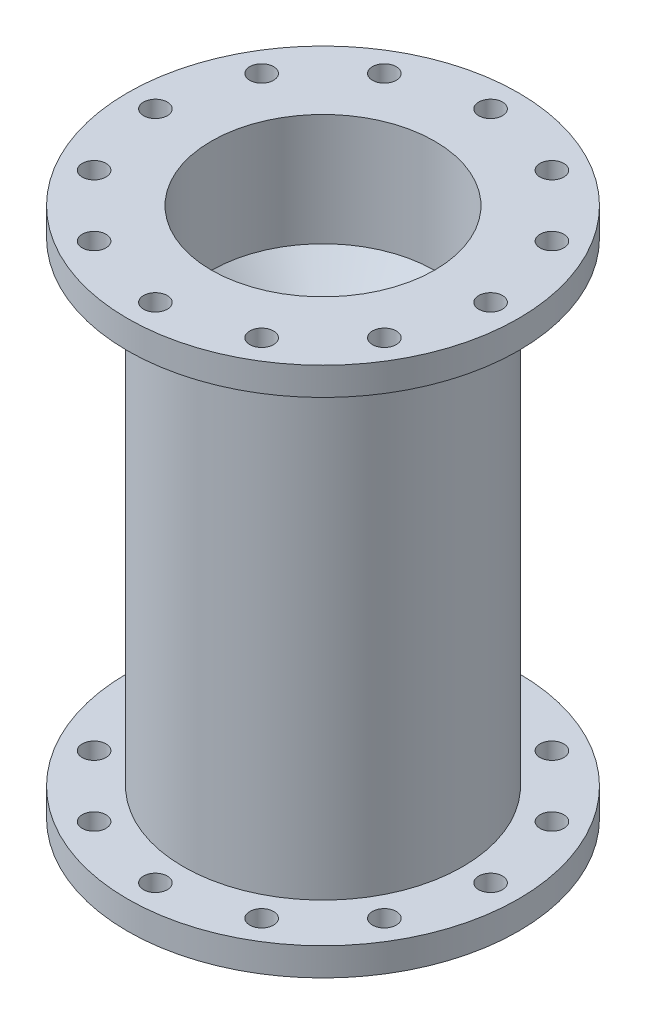
ISO-10303-21;
HEADER;
FILE_DESCRIPTION(('STEP AP214'),'2;1');
FILE_NAME('part.step','',(''),(''),'','','');
FILE_SCHEMA(('AUTOMOTIVE_DESIGN { 1 0 10303 214 1 1 1 1 }'));
ENDSEC;
DATA;
#1=APPLICATION_CONTEXT('core data for automotive mechanical design processes');
#2=APPLICATION_PROTOCOL_DEFINITION('international standard','automotive_design',2000,#1);
#3=PRODUCT_CONTEXT('',#1,'mechanical');
#4=PRODUCT('Part','Part','',(#3));
#5=PRODUCT_RELATED_PRODUCT_CATEGORY('part','',(#4));
#6=PRODUCT_DEFINITION_FORMATION('','',#4);
#7=PRODUCT_DEFINITION_CONTEXT('part definition',#1,'design');
#8=PRODUCT_DEFINITION('design','',#6,#7);
#9=PRODUCT_DEFINITION_SHAPE('','',#8);
#10=(LENGTH_UNIT() NAMED_UNIT(*) SI_UNIT(.MILLI.,.METRE.));
#11=(NAMED_UNIT(*) PLANE_ANGLE_UNIT() SI_UNIT($,.RADIAN.));
#12=(NAMED_UNIT(*) SI_UNIT($,.STERADIAN.) SOLID_ANGLE_UNIT());
#13=UNCERTAINTY_MEASURE_WITH_UNIT(LENGTH_MEASURE(1.E-05),#10,'distance_accuracy_value','');
#14=(GEOMETRIC_REPRESENTATION_CONTEXT(3) GLOBAL_UNCERTAINTY_ASSIGNED_CONTEXT((#13)) GLOBAL_UNIT_ASSIGNED_CONTEXT((#10,
#11,#12)) REPRESENTATION_CONTEXT('',''));
#15=CARTESIAN_POINT('',(0.,0.,0.));
#16=DIRECTION('',(0.,0.,1.));
#17=DIRECTION('',(1.,0.,0.));
#18=AXIS2_PLACEMENT_3D('',#15,#16,#17);
#19=CARTESIAN_POINT('',(0.,0.,-31.75));
#20=DIRECTION('',(0.,-1.,0.));
#21=DIRECTION('',(0.,0.,-1.));
#22=AXIS2_PLACEMENT_3D('',#19,#20,#21);
#23=PLANE('',#22);
#24=CARTESIAN_POINT('',(-38.1,0.,0.));
#25=DIRECTION('',(0.,1.,0.));
#26=DIRECTION('',(0.,0.,1.));
#27=AXIS2_PLACEMENT_3D('',#24,#25,#26);
#28=CIRCLE('',#27,2.70509999999999);
#29=CARTESIAN_POINT('',(-38.1,0.,2.70509999999998));
#30=VERTEX_POINT('',#29);
#31=EDGE_CURVE('E290',#30,#30,#28,.T.);
#32=ORIENTED_EDGE('',*,*,#31,.T.);
#33=EDGE_LOOP('',(#32));
#34=FACE_BOUND('',#33,.T.);
#35=CARTESIAN_POINT('',(-19.05,0.,-32.9955678841871));
#36=DIRECTION('',(0.,1.,0.));
#37=DIRECTION('',(0.,0.,1.));
#38=AXIS2_PLACEMENT_3D('',#35,#36,#37);
#39=CIRCLE('',#38,2.70509999999998);
#40=CARTESIAN_POINT('',(-19.05,0.,-30.2904678841871));
#41=VERTEX_POINT('',#40);
#42=EDGE_CURVE('E82',#41,#41,#39,.T.);
#43=ORIENTED_EDGE('',*,*,#42,.T.);
#44=EDGE_LOOP('',(#43));
#45=FACE_BOUND('',#44,.T.);
#46=CARTESIAN_POINT('',(0.,0.,-38.1));
#47=DIRECTION('',(0.,1.,0.));
#48=DIRECTION('',(0.,0.,1.));
#49=AXIS2_PLACEMENT_3D('',#46,#47,#48);
#50=CIRCLE('',#49,2.70509999999999);
#51=CARTESIAN_POINT('',(0.,0.,-35.3949));
#52=VERTEX_POINT('',#51);
#53=EDGE_CURVE('E104',#52,#52,#50,.T.);
#54=ORIENTED_EDGE('',*,*,#53,.T.);
#55=EDGE_LOOP('',(#54));
#56=FACE_BOUND('',#55,.T.);
#57=CARTESIAN_POINT('',(19.05,0.,-32.9955678841871));
#58=DIRECTION('',(0.,1.,0.));
#59=DIRECTION('',(0.,0.,1.));
#60=AXIS2_PLACEMENT_3D('',#57,#58,#59);
#61=CIRCLE('',#60,2.70509999999998);
#62=CARTESIAN_POINT('',(19.05,0.,-30.2904678841871));
#63=VERTEX_POINT('',#62);
#64=EDGE_CURVE('E77',#63,#63,#61,.T.);
#65=ORIENTED_EDGE('',*,*,#64,.T.);
#66=EDGE_LOOP('',(#65));
#67=FACE_BOUND('',#66,.T.);
#68=CARTESIAN_POINT('',(32.9955678841871,0.,-19.05));
#69=DIRECTION('',(0.,1.,0.));
#70=DIRECTION('',(0.,0.,1.));
#71=AXIS2_PLACEMENT_3D('',#68,#69,#70);
#72=CIRCLE('',#71,2.70509999999999);
#73=CARTESIAN_POINT('',(32.9955678841871,0.,-16.3449));
#74=VERTEX_POINT('',#73);
#75=EDGE_CURVE('E130',#74,#74,#72,.T.);
#76=ORIENTED_EDGE('',*,*,#75,.T.);
#77=EDGE_LOOP('',(#76));
#78=FACE_BOUND('',#77,.T.);
#79=CARTESIAN_POINT('',(38.1,0.,0.));
#80=DIRECTION('',(0.,1.,0.));
#81=DIRECTION('',(0.,0.,1.));
#82=AXIS2_PLACEMENT_3D('',#79,#80,#81);
#83=CIRCLE('',#82,2.70509999999999);
#84=CARTESIAN_POINT('',(38.1,0.,2.70509999999999));
#85=VERTEX_POINT('',#84);
#86=EDGE_CURVE('E146',#85,#85,#83,.T.);
#87=ORIENTED_EDGE('',*,*,#86,.T.);
#88=EDGE_LOOP('',(#87));
#89=FACE_BOUND('',#88,.T.);
#90=CARTESIAN_POINT('',(0.,0.,0.));
#91=DIRECTION('',(0.,-1.,0.));
#92=DIRECTION('',(0.,0.,-1.));
#93=AXIS2_PLACEMENT_3D('',#90,#91,#92);
#94=CIRCLE('',#93,25.4);
#95=CARTESIAN_POINT('',(0.,0.,-25.4));
#96=VERTEX_POINT('',#95);
#97=EDGE_CURVE('E234',#96,#96,#94,.T.);
#98=ORIENTED_EDGE('',*,*,#97,.F.);
#99=EDGE_LOOP('',(#98));
#100=FACE_BOUND('',#99,.T.);
#101=CARTESIAN_POINT('',(0.,0.,0.));
#102=DIRECTION('',(0.,-1.,0.));
#103=DIRECTION('',(0.,0.,-1.));
#104=AXIS2_PLACEMENT_3D('',#101,#102,#103);
#105=CIRCLE('',#104,44.45);
#106=CARTESIAN_POINT('',(0.,0.,-44.45));
#107=VERTEX_POINT('',#106);
#108=EDGE_CURVE('E57',#107,#107,#105,.T.);
#109=ORIENTED_EDGE('',*,*,#108,.T.);
#110=EDGE_LOOP('',(#109));
#111=FACE_BOUND('',#110,.T.);
#112=CARTESIAN_POINT('',(-32.9955678841871,0.,19.05));
#113=DIRECTION('',(0.,1.,0.));
#114=DIRECTION('',(0.,0.,1.));
#115=AXIS2_PLACEMENT_3D('',#112,#113,#114);
#116=CIRCLE('',#115,2.70509999999998);
#117=CARTESIAN_POINT('',(-32.9955678841871,0.,21.7551));
#118=VERTEX_POINT('',#117);
#119=EDGE_CURVE('E66',#118,#118,#116,.T.);
#120=ORIENTED_EDGE('',*,*,#119,.T.);
#121=EDGE_LOOP('',(#120));
#122=FACE_BOUND('',#121,.T.);
#123=CARTESIAN_POINT('',(-19.05,0.,32.9955678841871));
#124=DIRECTION('',(0.,1.,0.));
#125=DIRECTION('',(0.,0.,1.));
#126=AXIS2_PLACEMENT_3D('',#123,#124,#125);
#127=CIRCLE('',#126,2.70509999999998);
#128=CARTESIAN_POINT('',(-19.05,0.,35.7006678841871));
#129=VERTEX_POINT('',#128);
#130=EDGE_CURVE('E204',#129,#129,#127,.T.);
#131=ORIENTED_EDGE('',*,*,#130,.T.);
#132=EDGE_LOOP('',(#131));
#133=FACE_BOUND('',#132,.T.);
#134=CARTESIAN_POINT('',(0.,0.,38.1));
#135=DIRECTION('',(0.,1.,0.));
#136=DIRECTION('',(0.,0.,1.));
#137=AXIS2_PLACEMENT_3D('',#134,#135,#136);
#138=CIRCLE('',#137,2.70509999999999);
#139=CARTESIAN_POINT('',(0.,0.,40.8051));
#140=VERTEX_POINT('',#139);
#141=EDGE_CURVE('E188',#140,#140,#138,.T.);
#142=ORIENTED_EDGE('',*,*,#141,.T.);
#143=EDGE_LOOP('',(#142));
#144=FACE_BOUND('',#143,.T.);
#145=CARTESIAN_POINT('',(19.05,0.,32.9955678841871));
#146=DIRECTION('',(0.,1.,0.));
#147=DIRECTION('',(0.,0.,1.));
#148=AXIS2_PLACEMENT_3D('',#145,#146,#147);
#149=CIRCLE('',#148,2.70509999999998);
#150=CARTESIAN_POINT('',(19.05,0.,35.7006678841871));
#151=VERTEX_POINT('',#150);
#152=EDGE_CURVE('E172',#151,#151,#149,.T.);
#153=ORIENTED_EDGE('',*,*,#152,.T.);
#154=EDGE_LOOP('',(#153));
#155=FACE_BOUND('',#154,.T.);
#156=CARTESIAN_POINT('',(32.9955678841871,0.,19.05));
#157=DIRECTION('',(0.,1.,0.));
#158=DIRECTION('',(0.,0.,1.));
#159=AXIS2_PLACEMENT_3D('',#156,#157,#158);
#160=CIRCLE('',#159,2.70509999999999);
#161=CARTESIAN_POINT('',(32.9955678841871,0.,21.7551));
#162=VERTEX_POINT('',#161);
#163=EDGE_CURVE('E72',#162,#162,#160,.T.);
#164=ORIENTED_EDGE('',*,*,#163,.T.);
#165=EDGE_LOOP('',(#164));
#166=FACE_BOUND('',#165,.T.);
#167=CARTESIAN_POINT('',(-32.9955678841871,0.,-19.05));
#168=DIRECTION('',(0.,1.,0.));
#169=DIRECTION('',(0.,0.,1.));
#170=AXIS2_PLACEMENT_3D('',#167,#168,#169);
#171=CIRCLE('',#170,2.70509999999998);
#172=CARTESIAN_POINT('',(-32.9955678841871,0.,-16.3449));
#173=VERTEX_POINT('',#172);
#174=EDGE_CURVE('E631',#173,#173,#171,.T.);
#175=ORIENTED_EDGE('',*,*,#174,.T.);
#176=EDGE_LOOP('',(#175));
#177=FACE_BOUND('',#176,.T.);
#178=ADVANCED_FACE('F43',(#34,#45,#56,#67,#78,#89,#100,#111,#122,#133,#144,#155,#166,#177),#23,.T.);
#179=CARTESIAN_POINT('',(0.,0.,0.));
#180=DIRECTION('',(0.,-1.,0.));
#181=DIRECTION('',(0.,0.,-1.));
#182=AXIS2_PLACEMENT_3D('',#179,#180,#181);
#183=CYLINDRICAL_SURFACE('',#182,25.4);
#184=CARTESIAN_POINT('',(0.,92.64370836828,0.));
#185=DIRECTION('',(0.,1.,0.));
#186=DIRECTION('',(0.,0.,1.));
#187=AXIS2_PLACEMENT_3D('',#184,#185,#186);
#188=CIRCLE('',#187,25.4);
#189=CARTESIAN_POINT('',(0.,92.64370836828,25.4));
#190=VERTEX_POINT('',#189);
#191=EDGE_CURVE('E10',#190,#190,#188,.F.);
#192=ORIENTED_EDGE('',*,*,#191,.F.);
#193=EDGE_LOOP('',(#192));
#194=FACE_BOUND('',#193,.T.);
#195=ORIENTED_EDGE('',*,*,#97,.T.);
#196=EDGE_LOOP('',(#195));
#197=FACE_BOUND('',#196,.T.);
#198=ADVANCED_FACE('F270',(#194,#197),#183,.F.);
#199=CARTESIAN_POINT('',(0.,0.,0.));
#200=DIRECTION('',(0.,-1.,0.));
#201=DIRECTION('',(0.,0.,-1.));
#202=AXIS2_PLACEMENT_3D('',#199,#200,#201);
#203=CYLINDRICAL_SURFACE('',#202,44.45);
#204=CARTESIAN_POINT('',(0.,6.35,0.));
#205=DIRECTION('',(0.,-1.,0.));
#206=DIRECTION('',(0.,0.,-1.));
#207=AXIS2_PLACEMENT_3D('',#204,#205,#206);
#208=CIRCLE('',#207,44.45);
#209=CARTESIAN_POINT('',(0.,6.35,-44.45));
#210=VERTEX_POINT('',#209);
#211=EDGE_CURVE('E258',#210,#210,#208,.T.);
#212=ORIENTED_EDGE('',*,*,#211,.T.);
#213=EDGE_LOOP('',(#212));
#214=FACE_BOUND('',#213,.T.);
#215=ORIENTED_EDGE('',*,*,#108,.F.);
#216=EDGE_LOOP('',(#215));
#217=FACE_BOUND('',#216,.T.);
#218=ADVANCED_FACE('F267',(#214,#217),#203,.T.);
#219=CARTESIAN_POINT('',(0.,6.35,-44.45));
#220=DIRECTION('',(0.,1.,0.));
#221=DIRECTION('',(0.,0.,1.));
#222=AXIS2_PLACEMENT_3D('',#219,#220,#221);
#223=PLANE('',#222);
#224=CARTESIAN_POINT('',(-38.1,6.34999999999999,0.));
#225=DIRECTION('',(0.,1.,0.));
#226=DIRECTION('',(0.,0.,1.));
#227=AXIS2_PLACEMENT_3D('',#224,#225,#226);
#228=CIRCLE('',#227,2.70509999999999);
#229=CARTESIAN_POINT('',(-38.1,6.34999999999999,2.70509999999998));
#230=VERTEX_POINT('',#229);
#231=EDGE_CURVE('E613',#230,#230,#228,.T.);
#232=ORIENTED_EDGE('',*,*,#231,.F.);
#233=EDGE_LOOP('',(#232));
#234=FACE_BOUND('',#233,.T.);
#235=CARTESIAN_POINT('',(-32.9955678841871,6.34999999999999,-19.05));
#236=DIRECTION('',(0.,1.,0.));
#237=DIRECTION('',(0.,0.,1.));
#238=AXIS2_PLACEMENT_3D('',#235,#236,#237);
#239=CIRCLE('',#238,2.70509999999999);
#240=CARTESIAN_POINT('',(-32.9955678841871,6.34999999999999,-16.3449));
#241=VERTEX_POINT('',#240);
#242=EDGE_CURVE('E97',#241,#241,#239,.T.);
#243=ORIENTED_EDGE('',*,*,#242,.F.);
#244=EDGE_LOOP('',(#243));
#245=FACE_BOUND('',#244,.T.);
#246=CARTESIAN_POINT('',(-19.05,6.34999999999999,-32.9955678841871));
#247=DIRECTION('',(0.,1.,0.));
#248=DIRECTION('',(0.,0.,1.));
#249=AXIS2_PLACEMENT_3D('',#246,#247,#248);
#250=CIRCLE('',#249,2.70509999999999);
#251=CARTESIAN_POINT('',(-19.05,6.34999999999999,-30.2904678841871));
#252=VERTEX_POINT('',#251);
#253=EDGE_CURVE('E81',#252,#252,#250,.T.);
#254=ORIENTED_EDGE('',*,*,#253,.F.);
#255=EDGE_LOOP('',(#254));
#256=FACE_BOUND('',#255,.T.);
#257=CARTESIAN_POINT('',(0.,6.34999999999999,-38.1));
#258=DIRECTION('',(0.,1.,0.));
#259=DIRECTION('',(0.,0.,1.));
#260=AXIS2_PLACEMENT_3D('',#257,#258,#259);
#261=CIRCLE('',#260,2.70509999999999);
#262=CARTESIAN_POINT('',(0.,6.34999999999999,-35.3949));
#263=VERTEX_POINT('',#262);
#264=EDGE_CURVE('E108',#263,#263,#261,.T.);
#265=ORIENTED_EDGE('',*,*,#264,.F.);
#266=EDGE_LOOP('',(#265));
#267=FACE_BOUND('',#266,.T.);
#268=CARTESIAN_POINT('',(19.05,6.34999999999999,-32.9955678841871));
#269=DIRECTION('',(0.,1.,0.));
#270=DIRECTION('',(0.,0.,1.));
#271=AXIS2_PLACEMENT_3D('',#268,#269,#270);
#272=CIRCLE('',#271,2.70509999999999);
#273=CARTESIAN_POINT('',(19.05,6.34999999999999,-30.2904678841871));
#274=VERTEX_POINT('',#273);
#275=EDGE_CURVE('E73',#274,#274,#272,.T.);
#276=ORIENTED_EDGE('',*,*,#275,.F.);
#277=EDGE_LOOP('',(#276));
#278=FACE_BOUND('',#277,.T.);
#279=CARTESIAN_POINT('',(32.9955678841871,6.34999999999999,-19.05));
#280=DIRECTION('',(0.,1.,0.));
#281=DIRECTION('',(0.,0.,1.));
#282=AXIS2_PLACEMENT_3D('',#279,#280,#281);
#283=CIRCLE('',#282,2.70509999999999);
#284=CARTESIAN_POINT('',(32.9955678841871,6.34999999999999,-16.3449));
#285=VERTEX_POINT('',#284);
#286=EDGE_CURVE('E134',#285,#285,#283,.T.);
#287=ORIENTED_EDGE('',*,*,#286,.F.);
#288=EDGE_LOOP('',(#287));
#289=FACE_BOUND('',#288,.T.);
#290=CARTESIAN_POINT('',(38.1,6.34999999999999,0.));
#291=DIRECTION('',(0.,1.,0.));
#292=DIRECTION('',(0.,0.,1.));
#293=AXIS2_PLACEMENT_3D('',#290,#291,#292);
#294=CIRCLE('',#293,2.70509999999999);
#295=CARTESIAN_POINT('',(38.1,6.34999999999999,2.70509999999999));
#296=VERTEX_POINT('',#295);
#297=EDGE_CURVE('E154',#296,#296,#294,.T.);
#298=ORIENTED_EDGE('',*,*,#297,.F.);
#299=EDGE_LOOP('',(#298));
#300=FACE_BOUND('',#299,.T.);
#301=CARTESIAN_POINT('',(32.9955678841871,6.34999999999999,19.05));
#302=DIRECTION('',(0.,1.,0.));
#303=DIRECTION('',(0.,0.,1.));
#304=AXIS2_PLACEMENT_3D('',#301,#302,#303);
#305=CIRCLE('',#304,2.70509999999999);
#306=CARTESIAN_POINT('',(32.9955678841871,6.34999999999999,21.7551));
#307=VERTEX_POINT('',#306);
#308=EDGE_CURVE('E71',#307,#307,#305,.T.);
#309=ORIENTED_EDGE('',*,*,#308,.F.);
#310=EDGE_LOOP('',(#309));
#311=FACE_BOUND('',#310,.T.);
#312=CARTESIAN_POINT('',(19.05,6.34999999999999,32.9955678841871));
#313=DIRECTION('',(0.,1.,0.));
#314=DIRECTION('',(0.,0.,1.));
#315=AXIS2_PLACEMENT_3D('',#312,#313,#314);
#316=CIRCLE('',#315,2.70509999999999);
#317=CARTESIAN_POINT('',(19.05,6.34999999999999,35.7006678841871));
#318=VERTEX_POINT('',#317);
#319=EDGE_CURVE('E180',#318,#318,#316,.T.);
#320=ORIENTED_EDGE('',*,*,#319,.F.);
#321=EDGE_LOOP('',(#320));
#322=FACE_BOUND('',#321,.T.);
#323=CARTESIAN_POINT('',(0.,6.34999999999999,38.1));
#324=DIRECTION('',(0.,1.,0.));
#325=DIRECTION('',(0.,0.,1.));
#326=AXIS2_PLACEMENT_3D('',#323,#324,#325);
#327=CIRCLE('',#326,2.70509999999999);
#328=CARTESIAN_POINT('',(0.,6.34999999999999,40.8051));
#329=VERTEX_POINT('',#328);
#330=EDGE_CURVE('E192',#329,#329,#327,.T.);
#331=ORIENTED_EDGE('',*,*,#330,.F.);
#332=EDGE_LOOP('',(#331));
#333=FACE_BOUND('',#332,.T.);
#334=CARTESIAN_POINT('',(-19.05,6.34999999999999,32.9955678841871));
#335=DIRECTION('',(0.,1.,0.));
#336=DIRECTION('',(0.,0.,1.));
#337=AXIS2_PLACEMENT_3D('',#334,#335,#336);
#338=CIRCLE('',#337,2.70509999999999);
#339=CARTESIAN_POINT('',(-19.05,6.34999999999999,35.7006678841871));
#340=VERTEX_POINT('',#339);
#341=EDGE_CURVE('E208',#340,#340,#338,.T.);
#342=ORIENTED_EDGE('',*,*,#341,.F.);
#343=EDGE_LOOP('',(#342));
#344=FACE_BOUND('',#343,.T.);
#345=CARTESIAN_POINT('',(-32.9955678841871,6.34999999999999,19.05));
#346=DIRECTION('',(0.,1.,0.));
#347=DIRECTION('',(0.,0.,1.));
#348=AXIS2_PLACEMENT_3D('',#345,#346,#347);
#349=CIRCLE('',#348,2.70509999999999);
#350=CARTESIAN_POINT('',(-32.9955678841871,6.34999999999999,21.7551));
#351=VERTEX_POINT('',#350);
#352=EDGE_CURVE('E61',#351,#351,#349,.T.);
#353=ORIENTED_EDGE('',*,*,#352,.F.);
#354=EDGE_LOOP('',(#353));
#355=FACE_BOUND('',#354,.T.);
#356=CARTESIAN_POINT('',(0.,6.35,0.));
#357=DIRECTION('',(0.,-1.,0.));
#358=DIRECTION('',(0.,0.,-1.));
#359=AXIS2_PLACEMENT_3D('',#356,#357,#358);
#360=CIRCLE('',#359,31.75);
#361=CARTESIAN_POINT('',(0.,6.35,-31.75));
#362=VERTEX_POINT('',#361);
#363=EDGE_CURVE('E254',#362,#362,#360,.T.);
#364=ORIENTED_EDGE('',*,*,#363,.T.);
#365=EDGE_LOOP('',(#364));
#366=FACE_BOUND('',#365,.T.);
#367=ORIENTED_EDGE('',*,*,#211,.F.);
#368=EDGE_LOOP('',(#367));
#369=FACE_BOUND('',#368,.T.);
#370=ADVANCED_FACE('F269',(#234,#245,#256,#267,#278,#289,#300,#311,#322,#333,#344,#355,#366,
#369),#223,.T.);
#371=CARTESIAN_POINT('',(0.,0.,0.));
#372=DIRECTION('',(0.,-1.,0.));
#373=DIRECTION('',(0.,0.,-1.));
#374=AXIS2_PLACEMENT_3D('',#371,#372,#373);
#375=CYLINDRICAL_SURFACE('',#374,31.75);
#376=CARTESIAN_POINT('',(0.,114.3,0.));
#377=DIRECTION('',(0.,-1.,0.));
#378=DIRECTION('',(0.,0.,-1.));
#379=AXIS2_PLACEMENT_3D('',#376,#377,#378);
#380=CIRCLE('',#379,31.75);
#381=CARTESIAN_POINT('',(0.,114.3,-31.75));
#382=VERTEX_POINT('',#381);
#383=EDGE_CURVE('E250',#382,#382,#380,.T.);
#384=ORIENTED_EDGE('',*,*,#383,.T.);
#385=EDGE_LOOP('',(#384));
#386=FACE_BOUND('',#385,.T.);
#387=ORIENTED_EDGE('',*,*,#363,.F.);
#388=EDGE_LOOP('',(#387));
#389=FACE_BOUND('',#388,.T.);
#390=ADVANCED_FACE('F276',(#386,#389),#375,.T.);
#391=CARTESIAN_POINT('',(0.,114.3,-44.45));
#392=DIRECTION('',(0.,-1.,0.));
#393=DIRECTION('',(0.,0.,-1.));
#394=AXIS2_PLACEMENT_3D('',#391,#392,#393);
#395=PLANE('',#394);
#396=CARTESIAN_POINT('',(-38.1,114.3,0.));
#397=DIRECTION('',(0.,-1.,0.));
#398=DIRECTION('',(0.,0.,-1.));
#399=AXIS2_PLACEMENT_3D('',#396,#397,#398);
#400=CIRCLE('',#399,2.70509999999999);
#401=CARTESIAN_POINT('',(-38.1,114.3,-2.70509999999999));
#402=VERTEX_POINT('',#401);
#403=EDGE_CURVE('E619',#402,#402,#400,.T.);
#404=ORIENTED_EDGE('',*,*,#403,.F.);
#405=EDGE_LOOP('',(#404));
#406=FACE_BOUND('',#405,.T.);
#407=CARTESIAN_POINT('',(-32.9955678841871,114.3,-19.05));
#408=DIRECTION('',(0.,-1.,0.));
#409=DIRECTION('',(0.,0.,-1.));
#410=AXIS2_PLACEMENT_3D('',#407,#408,#409);
#411=CIRCLE('',#410,2.70509999999999);
#412=CARTESIAN_POINT('',(-32.9955678841871,114.3,-21.7551));
#413=VERTEX_POINT('',#412);
#414=EDGE_CURVE('E46',#413,#413,#411,.T.);
#415=ORIENTED_EDGE('',*,*,#414,.F.);
#416=EDGE_LOOP('',(#415));
#417=FACE_BOUND('',#416,.T.);
#418=CARTESIAN_POINT('',(-19.05,114.3,-32.9955678841871));
#419=DIRECTION('',(0.,-1.,0.));
#420=DIRECTION('',(0.,0.,-1.));
#421=AXIS2_PLACEMENT_3D('',#418,#419,#420);
#422=CIRCLE('',#421,2.70509999999999);
#423=CARTESIAN_POINT('',(-19.05,114.3,-35.7006678841871));
#424=VERTEX_POINT('',#423);
#425=EDGE_CURVE('E78',#424,#424,#422,.T.);
#426=ORIENTED_EDGE('',*,*,#425,.F.);
#427=EDGE_LOOP('',(#426));
#428=FACE_BOUND('',#427,.T.);
#429=CARTESIAN_POINT('',(0.,114.3,-38.1));
#430=DIRECTION('',(0.,-1.,0.));
#431=DIRECTION('',(0.,0.,-1.));
#432=AXIS2_PLACEMENT_3D('',#429,#430,#431);
#433=CIRCLE('',#432,2.70509999999999);
#434=CARTESIAN_POINT('',(0.,114.3,-40.8051));
#435=VERTEX_POINT('',#434);
#436=EDGE_CURVE('E112',#435,#435,#433,.T.);
#437=ORIENTED_EDGE('',*,*,#436,.F.);
#438=EDGE_LOOP('',(#437));
#439=FACE_BOUND('',#438,.T.);
#440=CARTESIAN_POINT('',(19.05,114.3,-32.9955678841871));
#441=DIRECTION('',(0.,-1.,0.));
#442=DIRECTION('',(0.,0.,-1.));
#443=AXIS2_PLACEMENT_3D('',#440,#441,#442);
#444=CIRCLE('',#443,2.70509999999999);
#445=CARTESIAN_POINT('',(19.05,114.3,-35.7006678841871));
#446=VERTEX_POINT('',#445);
#447=EDGE_CURVE('E76',#446,#446,#444,.T.);
#448=ORIENTED_EDGE('',*,*,#447,.F.);
#449=EDGE_LOOP('',(#448));
#450=FACE_BOUND('',#449,.T.);
#451=CARTESIAN_POINT('',(32.9955678841871,114.3,-19.05));
#452=DIRECTION('',(0.,-1.,0.));
#453=DIRECTION('',(0.,0.,-1.));
#454=AXIS2_PLACEMENT_3D('',#451,#452,#453);
#455=CIRCLE('',#454,2.70509999999999);
#456=CARTESIAN_POINT('',(32.9955678841871,114.3,-21.7551));
#457=VERTEX_POINT('',#456);
#458=EDGE_CURVE('E138',#457,#457,#455,.T.);
#459=ORIENTED_EDGE('',*,*,#458,.F.);
#460=EDGE_LOOP('',(#459));
#461=FACE_BOUND('',#460,.T.);
#462=CARTESIAN_POINT('',(38.1,114.3,0.));
#463=DIRECTION('',(0.,-1.,0.));
#464=DIRECTION('',(0.,0.,-1.));
#465=AXIS2_PLACEMENT_3D('',#462,#463,#464);
#466=CIRCLE('',#465,2.70509999999999);
#467=CARTESIAN_POINT('',(38.1,114.3,-2.70509999999999));
#468=VERTEX_POINT('',#467);
#469=EDGE_CURVE('E150',#468,#468,#466,.T.);
#470=ORIENTED_EDGE('',*,*,#469,.F.);
#471=EDGE_LOOP('',(#470));
#472=FACE_BOUND('',#471,.T.);
#473=CARTESIAN_POINT('',(32.9955678841871,114.3,19.05));
#474=DIRECTION('',(0.,-1.,0.));
#475=DIRECTION('',(0.,0.,-1.));
#476=AXIS2_PLACEMENT_3D('',#473,#474,#475);
#477=CIRCLE('',#476,2.70509999999999);
#478=CARTESIAN_POINT('',(32.9955678841871,114.3,16.3449));
#479=VERTEX_POINT('',#478);
#480=EDGE_CURVE('E67',#479,#479,#477,.T.);
#481=ORIENTED_EDGE('',*,*,#480,.F.);
#482=EDGE_LOOP('',(#481));
#483=FACE_BOUND('',#482,.T.);
#484=CARTESIAN_POINT('',(19.05,114.3,32.9955678841871));
#485=DIRECTION('',(0.,-1.,0.));
#486=DIRECTION('',(0.,0.,-1.));
#487=AXIS2_PLACEMENT_3D('',#484,#485,#486);
#488=CIRCLE('',#487,2.70509999999999);
#489=CARTESIAN_POINT('',(19.05,114.3,30.2904678841871));
#490=VERTEX_POINT('',#489);
#491=EDGE_CURVE('E176',#490,#490,#488,.T.);
#492=ORIENTED_EDGE('',*,*,#491,.F.);
#493=EDGE_LOOP('',(#492));
#494=FACE_BOUND('',#493,.T.);
#495=CARTESIAN_POINT('',(0.,114.3,38.1));
#496=DIRECTION('',(0.,-1.,0.));
#497=DIRECTION('',(0.,0.,-1.));
#498=AXIS2_PLACEMENT_3D('',#495,#496,#497);
#499=CIRCLE('',#498,2.70509999999999);
#500=CARTESIAN_POINT('',(0.,114.3,35.3949));
#501=VERTEX_POINT('',#500);
#502=EDGE_CURVE('E196',#501,#501,#499,.T.);
#503=ORIENTED_EDGE('',*,*,#502,.F.);
#504=EDGE_LOOP('',(#503));
#505=FACE_BOUND('',#504,.T.);
#506=CARTESIAN_POINT('',(-19.05,114.3,32.9955678841871));
#507=DIRECTION('',(0.,-1.,0.));
#508=DIRECTION('',(0.,0.,-1.));
#509=AXIS2_PLACEMENT_3D('',#506,#507,#508);
#510=CIRCLE('',#509,2.70509999999999);
#511=CARTESIAN_POINT('',(-19.05,114.3,30.2904678841871));
#512=VERTEX_POINT('',#511);
#513=EDGE_CURVE('E212',#512,#512,#510,.T.);
#514=ORIENTED_EDGE('',*,*,#513,.F.);
#515=EDGE_LOOP('',(#514));
#516=FACE_BOUND('',#515,.T.);
#517=CARTESIAN_POINT('',(-32.9955678841871,114.3,19.05));
#518=DIRECTION('',(0.,-1.,0.));
#519=DIRECTION('',(0.,0.,-1.));
#520=AXIS2_PLACEMENT_3D('',#517,#518,#519);
#521=CIRCLE('',#520,2.70509999999999);
#522=CARTESIAN_POINT('',(-32.9955678841871,114.3,16.3449));
#523=VERTEX_POINT('',#522);
#524=EDGE_CURVE('E65',#523,#523,#521,.T.);
#525=ORIENTED_EDGE('',*,*,#524,.F.);
#526=EDGE_LOOP('',(#525));
#527=FACE_BOUND('',#526,.T.);
#528=CARTESIAN_POINT('',(0.,114.3,0.));
#529=DIRECTION('',(0.,-1.,0.));
#530=DIRECTION('',(0.,0.,-1.));
#531=AXIS2_PLACEMENT_3D('',#528,#529,#530);
#532=CIRCLE('',#531,44.45);
#533=CARTESIAN_POINT('',(0.,114.3,-44.45));
#534=VERTEX_POINT('',#533);
#535=EDGE_CURVE('E246',#534,#534,#532,.T.);
#536=ORIENTED_EDGE('',*,*,#535,.T.);
#537=EDGE_LOOP('',(#536));
#538=FACE_BOUND('',#537,.T.);
#539=ORIENTED_EDGE('',*,*,#383,.F.);
#540=EDGE_LOOP('',(#539));
#541=FACE_BOUND('',#540,.T.);
#542=ADVANCED_FACE('F363',(#406,#417,#428,#439,#450,#461,#472,#483,#494,#505,#516,#527,#538,
#541),#395,.T.);
#543=CARTESIAN_POINT('',(0.,0.,0.));
#544=DIRECTION('',(0.,-1.,0.));
#545=DIRECTION('',(0.,0.,-1.));
#546=AXIS2_PLACEMENT_3D('',#543,#544,#545);
#547=CYLINDRICAL_SURFACE('',#546,44.45);
#548=CARTESIAN_POINT('',(0.,120.65,0.));
#549=DIRECTION('',(0.,-1.,0.));
#550=DIRECTION('',(0.,0.,-1.));
#551=AXIS2_PLACEMENT_3D('',#548,#549,#550);
#552=CIRCLE('',#551,44.45);
#553=CARTESIAN_POINT('',(0.,120.65,-44.45));
#554=VERTEX_POINT('',#553);
#555=EDGE_CURVE('E242',#554,#554,#552,.T.);
#556=ORIENTED_EDGE('',*,*,#555,.T.);
#557=EDGE_LOOP('',(#556));
#558=FACE_BOUND('',#557,.T.);
#559=ORIENTED_EDGE('',*,*,#535,.F.);
#560=EDGE_LOOP('',(#559));
#561=FACE_BOUND('',#560,.T.);
#562=ADVANCED_FACE('F359',(#558,#561),#547,.T.);
#563=CARTESIAN_POINT('',(0.,120.65,-25.4));
#564=DIRECTION('',(0.,1.,0.));
#565=DIRECTION('',(0.,0.,1.));
#566=AXIS2_PLACEMENT_3D('',#563,#564,#565);
#567=PLANE('',#566);
#568=CARTESIAN_POINT('',(-38.1,120.65,0.));
#569=DIRECTION('',(0.,1.,0.));
#570=DIRECTION('',(0.,0.,1.));
#571=AXIS2_PLACEMENT_3D('',#568,#569,#570);
#572=CIRCLE('',#571,2.70509999999999);
#573=CARTESIAN_POINT('',(-38.1,120.65,2.70509999999998));
#574=VERTEX_POINT('',#573);
#575=EDGE_CURVE('E615',#574,#574,#572,.T.);
#576=ORIENTED_EDGE('',*,*,#575,.F.);
#577=EDGE_LOOP('',(#576));
#578=FACE_BOUND('',#577,.T.);
#579=CARTESIAN_POINT('',(-32.9955678841871,120.65,-19.05));
#580=DIRECTION('',(0.,1.,0.));
#581=DIRECTION('',(0.,0.,1.));
#582=AXIS2_PLACEMENT_3D('',#579,#580,#581);
#583=CIRCLE('',#582,2.70509999999999);
#584=CARTESIAN_POINT('',(-32.9955678841871,120.65,-16.3449));
#585=VERTEX_POINT('',#584);
#586=EDGE_CURVE('E627',#585,#585,#583,.T.);
#587=ORIENTED_EDGE('',*,*,#586,.F.);
#588=EDGE_LOOP('',(#587));
#589=FACE_BOUND('',#588,.T.);
#590=CARTESIAN_POINT('',(-19.05,120.65,-32.9955678841871));
#591=DIRECTION('',(0.,1.,0.));
#592=DIRECTION('',(0.,0.,1.));
#593=AXIS2_PLACEMENT_3D('',#590,#591,#592);
#594=CIRCLE('',#593,2.70509999999999);
#595=CARTESIAN_POINT('',(-19.05,120.65,-30.2904678841871));
#596=VERTEX_POINT('',#595);
#597=EDGE_CURVE('E91',#596,#596,#594,.T.);
#598=ORIENTED_EDGE('',*,*,#597,.F.);
#599=EDGE_LOOP('',(#598));
#600=FACE_BOUND('',#599,.T.);
#601=CARTESIAN_POINT('',(0.,120.65,-38.1));
#602=DIRECTION('',(0.,1.,0.));
#603=DIRECTION('',(0.,0.,1.));
#604=AXIS2_PLACEMENT_3D('',#601,#602,#603);
#605=CIRCLE('',#604,2.70509999999999);
#606=CARTESIAN_POINT('',(0.,120.65,-35.3949));
#607=VERTEX_POINT('',#606);
#608=EDGE_CURVE('E88',#607,#607,#605,.T.);
#609=ORIENTED_EDGE('',*,*,#608,.F.);
#610=EDGE_LOOP('',(#609));
#611=FACE_BOUND('',#610,.T.);
#612=CARTESIAN_POINT('',(19.05,120.65,-32.9955678841871));
#613=DIRECTION('',(0.,1.,0.));
#614=DIRECTION('',(0.,0.,1.));
#615=AXIS2_PLACEMENT_3D('',#612,#613,#614);
#616=CIRCLE('',#615,2.70509999999999);
#617=CARTESIAN_POINT('',(19.05,120.65,-30.2904678841871));
#618=VERTEX_POINT('',#617);
#619=EDGE_CURVE('E116',#618,#618,#616,.T.);
#620=ORIENTED_EDGE('',*,*,#619,.F.);
#621=EDGE_LOOP('',(#620));
#622=FACE_BOUND('',#621,.T.);
#623=CARTESIAN_POINT('',(32.9955678841871,120.65,-19.05));
#624=DIRECTION('',(0.,1.,0.));
#625=DIRECTION('',(0.,0.,1.));
#626=AXIS2_PLACEMENT_3D('',#623,#624,#625);
#627=CIRCLE('',#626,2.70509999999999);
#628=CARTESIAN_POINT('',(32.9955678841871,120.65,-16.3449));
#629=VERTEX_POINT('',#628);
#630=EDGE_CURVE('E126',#629,#629,#627,.T.);
#631=ORIENTED_EDGE('',*,*,#630,.F.);
#632=EDGE_LOOP('',(#631));
#633=FACE_BOUND('',#632,.T.);
#634=CARTESIAN_POINT('',(38.1,120.65,0.));
#635=DIRECTION('',(0.,1.,0.));
#636=DIRECTION('',(0.,0.,1.));
#637=AXIS2_PLACEMENT_3D('',#634,#635,#636);
#638=CIRCLE('',#637,2.70509999999999);
#639=CARTESIAN_POINT('',(38.1,120.65,2.70509999999999));
#640=VERTEX_POINT('',#639);
#641=EDGE_CURVE('E142',#640,#640,#638,.T.);
#642=ORIENTED_EDGE('',*,*,#641,.F.);
#643=EDGE_LOOP('',(#642));
#644=FACE_BOUND('',#643,.T.);
#645=CARTESIAN_POINT('',(32.9955678841871,120.65,19.05));
#646=DIRECTION('',(0.,1.,0.));
#647=DIRECTION('',(0.,0.,1.));
#648=AXIS2_PLACEMENT_3D('',#645,#646,#647);
#649=CIRCLE('',#648,2.70509999999999);
#650=CARTESIAN_POINT('',(32.9955678841871,120.65,21.7551));
#651=VERTEX_POINT('',#650);
#652=EDGE_CURVE('E158',#651,#651,#649,.T.);
#653=ORIENTED_EDGE('',*,*,#652,.F.);
#654=EDGE_LOOP('',(#653));
#655=FACE_BOUND('',#654,.T.);
#656=CARTESIAN_POINT('',(19.05,120.65,32.9955678841871));
#657=DIRECTION('',(0.,1.,0.));
#658=DIRECTION('',(0.,0.,1.));
#659=AXIS2_PLACEMENT_3D('',#656,#657,#658);
#660=CIRCLE('',#659,2.70509999999999);
#661=CARTESIAN_POINT('',(19.05,120.65,35.7006678841871));
#662=VERTEX_POINT('',#661);
#663=EDGE_CURVE('E168',#662,#662,#660,.T.);
#664=ORIENTED_EDGE('',*,*,#663,.F.);
#665=EDGE_LOOP('',(#664));
#666=FACE_BOUND('',#665,.T.);
#667=CARTESIAN_POINT('',(0.,120.65,38.1));
#668=DIRECTION('',(0.,1.,0.));
#669=DIRECTION('',(0.,0.,1.));
#670=AXIS2_PLACEMENT_3D('',#667,#668,#669);
#671=CIRCLE('',#670,2.70509999999999);
#672=CARTESIAN_POINT('',(0.,120.65,40.8051));
#673=VERTEX_POINT('',#672);
#674=EDGE_CURVE('E184',#673,#673,#671,.T.);
#675=ORIENTED_EDGE('',*,*,#674,.F.);
#676=EDGE_LOOP('',(#675));
#677=FACE_BOUND('',#676,.T.);
#678=CARTESIAN_POINT('',(-19.05,120.65,32.9955678841871));
#679=DIRECTION('',(0.,1.,0.));
#680=DIRECTION('',(0.,0.,1.));
#681=AXIS2_PLACEMENT_3D('',#678,#679,#680);
#682=CIRCLE('',#681,2.70509999999999);
#683=CARTESIAN_POINT('',(-19.05,120.65,35.7006678841871));
#684=VERTEX_POINT('',#683);
#685=EDGE_CURVE('E200',#684,#684,#682,.T.);
#686=ORIENTED_EDGE('',*,*,#685,.F.);
#687=EDGE_LOOP('',(#686));
#688=FACE_BOUND('',#687,.T.);
#689=CARTESIAN_POINT('',(-32.9955678841871,120.65,19.05));
#690=DIRECTION('',(0.,1.,0.));
#691=DIRECTION('',(0.,0.,1.));
#692=AXIS2_PLACEMENT_3D('',#689,#690,#691);
#693=CIRCLE('',#692,2.70509999999999);
#694=CARTESIAN_POINT('',(-32.9955678841871,120.65,21.7551));
#695=VERTEX_POINT('',#694);
#696=EDGE_CURVE('E216',#695,#695,#693,.T.);
#697=ORIENTED_EDGE('',*,*,#696,.F.);
#698=EDGE_LOOP('',(#697));
#699=FACE_BOUND('',#698,.T.);
#700=CARTESIAN_POINT('',(0.,120.65,0.));
#701=DIRECTION('',(0.,-1.,0.));
#702=DIRECTION('',(0.,0.,-1.));
#703=AXIS2_PLACEMENT_3D('',#700,#701,#702);
#704=CIRCLE('',#703,25.4);
#705=CARTESIAN_POINT('',(0.,120.65,-25.4));
#706=VERTEX_POINT('',#705);
#707=EDGE_CURVE('E238',#706,#706,#704,.T.);
#708=ORIENTED_EDGE('',*,*,#707,.T.);
#709=EDGE_LOOP('',(#708));
#710=FACE_BOUND('',#709,.T.);
#711=ORIENTED_EDGE('',*,*,#555,.F.);
#712=EDGE_LOOP('',(#711));
#713=FACE_BOUND('',#712,.T.);
#714=ADVANCED_FACE('F355',(#578,#589,#600,#611,#622,#633,#644,#655,#666,#677,#688,#699,#710,
#713),#567,.T.);
#715=CARTESIAN_POINT('',(0.,95.18370836828,0.));
#716=DIRECTION('',(0.,1.,0.));
#717=DIRECTION('',(0.,0.,1.));
#718=AXIS2_PLACEMENT_3D('',#715,#716,#717);
#719=CIRCLE('',#718,25.4);
#720=CARTESIAN_POINT('',(0.,95.18370836828,25.4));
#721=VERTEX_POINT('',#720);
#722=EDGE_CURVE('E51',#721,#721,#719,.T.);
#723=ORIENTED_EDGE('',*,*,#722,.F.);
#724=EDGE_LOOP('',(#723));
#725=FACE_BOUND('',#724,.T.);
#726=ORIENTED_EDGE('',*,*,#707,.F.);
#727=EDGE_LOOP('',(#726));
#728=FACE_BOUND('',#727,.T.);
#729=ADVANCED_FACE('F282',(#725,#728),#183,.F.);
#730=CARTESIAN_POINT('',(0.,74.8637083682799,0.));
#731=DIRECTION('',(0.,1.,0.));
#732=DIRECTION('',(0.,0.,1.));
#733=AXIS2_PLACEMENT_3D('',#730,#731,#732);
#734=CONICAL_SURFACE('',#733,7.61999999999994,0.785398163397448);
#735=ORIENTED_EDGE('',*,*,#191,.T.);
#736=EDGE_LOOP('',(#735));
#737=FACE_BOUND('',#736,.T.);
#738=CARTESIAN_POINT('',(0.,74.8637083682799,0.));
#739=DIRECTION('',(0.,-1.,0.));
#740=DIRECTION('',(0.,0.,-1.));
#741=AXIS2_PLACEMENT_3D('',#738,#739,#740);
#742=CIRCLE('',#741,7.61999999999994);
#743=CARTESIAN_POINT('',(0.,74.8637083682799,-7.61999999999994));
#744=VERTEX_POINT('',#743);
#745=EDGE_CURVE('E226',#744,#744,#742,.T.);
#746=ORIENTED_EDGE('',*,*,#745,.F.);
#747=EDGE_LOOP('',(#746));
#748=FACE_BOUND('',#747,.T.);
#749=ADVANCED_FACE('F350',(#737,#748),#734,.T.);
#750=CARTESIAN_POINT('',(0.,95.18370836828,0.));
#751=DIRECTION('',(0.,1.,0.));
#752=DIRECTION('',(0.,0.,1.));
#753=AXIS2_PLACEMENT_3D('',#750,#751,#752);
#754=CONICAL_SURFACE('',#753,25.4,0.785398163397448);
#755=CARTESIAN_POINT('',(0.,77.4037083682799,0.));
#756=DIRECTION('',(0.,-1.,0.));
#757=DIRECTION('',(0.,0.,-1.));
#758=AXIS2_PLACEMENT_3D('',#755,#756,#757);
#759=CIRCLE('',#758,7.61999999999994);
#760=CARTESIAN_POINT('',(0.,77.4037083682799,-7.61999999999994));
#761=VERTEX_POINT('',#760);
#762=EDGE_CURVE('E230',#761,#761,#759,.T.);
#763=ORIENTED_EDGE('',*,*,#762,.T.);
#764=EDGE_LOOP('',(#763));
#765=FACE_BOUND('',#764,.T.);
#766=ORIENTED_EDGE('',*,*,#722,.T.);
#767=EDGE_LOOP('',(#766));
#768=FACE_BOUND('',#767,.T.);
#769=ADVANCED_FACE('F346',(#765,#768),#754,.F.);
#770=CARTESIAN_POINT('',(0.,0.,0.));
#771=DIRECTION('',(0.,-1.,0.));
#772=DIRECTION('',(0.,0.,-1.));
#773=AXIS2_PLACEMENT_3D('',#770,#771,#772);
#774=CYLINDRICAL_SURFACE('',#773,7.61999999999994);
#775=ORIENTED_EDGE('',*,*,#745,.T.);
#776=EDGE_LOOP('',(#775));
#777=FACE_BOUND('',#776,.T.);
#778=ORIENTED_EDGE('',*,*,#762,.F.);
#779=EDGE_LOOP('',(#778));
#780=FACE_BOUND('',#779,.T.);
#781=ADVANCED_FACE('F344',(#777,#780),#774,.F.);
#782=CARTESIAN_POINT('',(-32.9955678841871,120.65,19.05));
#783=DIRECTION('',(0.,1.,0.));
#784=DIRECTION('',(0.,0.,1.));
#785=AXIS2_PLACEMENT_3D('',#782,#783,#784);
#786=CYLINDRICAL_SURFACE('',#785,2.70509999999999);
#787=ORIENTED_EDGE('',*,*,#524,.T.);
#788=EDGE_LOOP('',(#787));
#789=FACE_BOUND('',#788,.T.);
#790=ORIENTED_EDGE('',*,*,#696,.T.);
#791=EDGE_LOOP('',(#790));
#792=FACE_BOUND('',#791,.T.);
#793=ADVANCED_FACE('F342',(#789,#792),#786,.F.);
#794=ORIENTED_EDGE('',*,*,#352,.T.);
#795=EDGE_LOOP('',(#794));
#796=FACE_BOUND('',#795,.T.);
#797=ORIENTED_EDGE('',*,*,#119,.F.);
#798=EDGE_LOOP('',(#797));
#799=FACE_BOUND('',#798,.T.);
#800=ADVANCED_FACE('F339',(#796,#799),#786,.F.);
#801=CARTESIAN_POINT('',(-19.05,120.65,32.9955678841871));
#802=DIRECTION('',(0.,1.,0.));
#803=DIRECTION('',(0.,0.,1.));
#804=AXIS2_PLACEMENT_3D('',#801,#802,#803);
#805=CYLINDRICAL_SURFACE('',#804,2.70509999999999);
#806=ORIENTED_EDGE('',*,*,#513,.T.);
#807=EDGE_LOOP('',(#806));
#808=FACE_BOUND('',#807,.T.);
#809=ORIENTED_EDGE('',*,*,#685,.T.);
#810=EDGE_LOOP('',(#809));
#811=FACE_BOUND('',#810,.T.);
#812=ADVANCED_FACE('F337',(#808,#811),#805,.F.);
#813=ORIENTED_EDGE('',*,*,#341,.T.);
#814=EDGE_LOOP('',(#813));
#815=FACE_BOUND('',#814,.T.);
#816=ORIENTED_EDGE('',*,*,#130,.F.);
#817=EDGE_LOOP('',(#816));
#818=FACE_BOUND('',#817,.T.);
#819=ADVANCED_FACE('F334',(#815,#818),#805,.F.);
#820=CARTESIAN_POINT('',(0.,120.65,38.1));
#821=DIRECTION('',(0.,1.,0.));
#822=DIRECTION('',(0.,0.,1.));
#823=AXIS2_PLACEMENT_3D('',#820,#821,#822);
#824=CYLINDRICAL_SURFACE('',#823,2.70509999999999);
#825=ORIENTED_EDGE('',*,*,#502,.T.);
#826=EDGE_LOOP('',(#825));
#827=FACE_BOUND('',#826,.T.);
#828=ORIENTED_EDGE('',*,*,#674,.T.);
#829=EDGE_LOOP('',(#828));
#830=FACE_BOUND('',#829,.T.);
#831=ADVANCED_FACE('F332',(#827,#830),#824,.F.);
#832=ORIENTED_EDGE('',*,*,#330,.T.);
#833=EDGE_LOOP('',(#832));
#834=FACE_BOUND('',#833,.T.);
#835=ORIENTED_EDGE('',*,*,#141,.F.);
#836=EDGE_LOOP('',(#835));
#837=FACE_BOUND('',#836,.T.);
#838=ADVANCED_FACE('F328',(#834,#837),#824,.F.);
#839=CARTESIAN_POINT('',(19.05,120.65,32.9955678841871));
#840=DIRECTION('',(0.,1.,0.));
#841=DIRECTION('',(0.,0.,1.));
#842=AXIS2_PLACEMENT_3D('',#839,#840,#841);
#843=CYLINDRICAL_SURFACE('',#842,2.70509999999999);
#844=ORIENTED_EDGE('',*,*,#491,.T.);
#845=EDGE_LOOP('',(#844));
#846=FACE_BOUND('',#845,.T.);
#847=ORIENTED_EDGE('',*,*,#663,.T.);
#848=EDGE_LOOP('',(#847));
#849=FACE_BOUND('',#848,.T.);
#850=ADVANCED_FACE('F325',(#846,#849),#843,.F.);
#851=ORIENTED_EDGE('',*,*,#319,.T.);
#852=EDGE_LOOP('',(#851));
#853=FACE_BOUND('',#852,.T.);
#854=ORIENTED_EDGE('',*,*,#152,.F.);
#855=EDGE_LOOP('',(#854));
#856=FACE_BOUND('',#855,.T.);
#857=ADVANCED_FACE('F323',(#853,#856),#843,.F.);
#858=CARTESIAN_POINT('',(32.9955678841871,120.65,19.05));
#859=DIRECTION('',(0.,1.,0.));
#860=DIRECTION('',(0.,0.,1.));
#861=AXIS2_PLACEMENT_3D('',#858,#859,#860);
#862=CYLINDRICAL_SURFACE('',#861,2.70509999999999);
#863=ORIENTED_EDGE('',*,*,#480,.T.);
#864=EDGE_LOOP('',(#863));
#865=FACE_BOUND('',#864,.T.);
#866=ORIENTED_EDGE('',*,*,#652,.T.);
#867=EDGE_LOOP('',(#866));
#868=FACE_BOUND('',#867,.T.);
#869=ADVANCED_FACE('F320',(#865,#868),#862,.F.);
#870=ORIENTED_EDGE('',*,*,#308,.T.);
#871=EDGE_LOOP('',(#870));
#872=FACE_BOUND('',#871,.T.);
#873=ORIENTED_EDGE('',*,*,#163,.F.);
#874=EDGE_LOOP('',(#873));
#875=FACE_BOUND('',#874,.T.);
#876=ADVANCED_FACE('F316',(#872,#875),#862,.F.);
#877=CARTESIAN_POINT('',(38.1,120.65,0.));
#878=DIRECTION('',(0.,1.,0.));
#879=DIRECTION('',(0.,0.,1.));
#880=AXIS2_PLACEMENT_3D('',#877,#878,#879);
#881=CYLINDRICAL_SURFACE('',#880,2.70509999999999);
#882=ORIENTED_EDGE('',*,*,#469,.T.);
#883=EDGE_LOOP('',(#882));
#884=FACE_BOUND('',#883,.T.);
#885=ORIENTED_EDGE('',*,*,#641,.T.);
#886=EDGE_LOOP('',(#885));
#887=FACE_BOUND('',#886,.T.);
#888=ADVANCED_FACE('F306',(#884,#887),#881,.F.);
#889=ORIENTED_EDGE('',*,*,#297,.T.);
#890=EDGE_LOOP('',(#889));
#891=FACE_BOUND('',#890,.T.);
#892=ORIENTED_EDGE('',*,*,#86,.F.);
#893=EDGE_LOOP('',(#892));
#894=FACE_BOUND('',#893,.T.);
#895=ADVANCED_FACE('F303',(#891,#894),#881,.F.);
#896=CARTESIAN_POINT('',(32.9955678841871,120.65,-19.05));
#897=DIRECTION('',(0.,1.,0.));
#898=DIRECTION('',(0.,0.,1.));
#899=AXIS2_PLACEMENT_3D('',#896,#897,#898);
#900=CYLINDRICAL_SURFACE('',#899,2.70509999999999);
#901=ORIENTED_EDGE('',*,*,#458,.T.);
#902=EDGE_LOOP('',(#901));
#903=FACE_BOUND('',#902,.T.);
#904=ORIENTED_EDGE('',*,*,#630,.T.);
#905=EDGE_LOOP('',(#904));
#906=FACE_BOUND('',#905,.T.);
#907=ADVANCED_FACE('F305',(#903,#906),#900,.F.);
#908=ORIENTED_EDGE('',*,*,#286,.T.);
#909=EDGE_LOOP('',(#908));
#910=FACE_BOUND('',#909,.T.);
#911=ORIENTED_EDGE('',*,*,#75,.F.);
#912=EDGE_LOOP('',(#911));
#913=FACE_BOUND('',#912,.T.);
#914=ADVANCED_FACE('F313',(#910,#913),#900,.F.);
#915=CARTESIAN_POINT('',(19.05,120.65,-32.9955678841871));
#916=DIRECTION('',(0.,1.,0.));
#917=DIRECTION('',(0.,0.,1.));
#918=AXIS2_PLACEMENT_3D('',#915,#916,#917);
#919=CYLINDRICAL_SURFACE('',#918,2.70509999999999);
#920=ORIENTED_EDGE('',*,*,#275,.T.);
#921=EDGE_LOOP('',(#920));
#922=FACE_BOUND('',#921,.T.);
#923=ORIENTED_EDGE('',*,*,#64,.F.);
#924=EDGE_LOOP('',(#923));
#925=FACE_BOUND('',#924,.T.);
#926=ADVANCED_FACE('F515',(#922,#925),#919,.F.);
#927=ORIENTED_EDGE('',*,*,#447,.T.);
#928=EDGE_LOOP('',(#927));
#929=FACE_BOUND('',#928,.T.);
#930=ORIENTED_EDGE('',*,*,#619,.T.);
#931=EDGE_LOOP('',(#930));
#932=FACE_BOUND('',#931,.T.);
#933=ADVANCED_FACE('F524',(#929,#932),#919,.F.);
#934=CARTESIAN_POINT('',(0.,120.65,-38.1));
#935=DIRECTION('',(0.,1.,0.));
#936=DIRECTION('',(0.,0.,1.));
#937=AXIS2_PLACEMENT_3D('',#934,#935,#936);
#938=CYLINDRICAL_SURFACE('',#937,2.70509999999999);
#939=ORIENTED_EDGE('',*,*,#436,.T.);
#940=EDGE_LOOP('',(#939));
#941=FACE_BOUND('',#940,.T.);
#942=ORIENTED_EDGE('',*,*,#608,.T.);
#943=EDGE_LOOP('',(#942));
#944=FACE_BOUND('',#943,.T.);
#945=ADVANCED_FACE('F533',(#941,#944),#938,.F.);
#946=ORIENTED_EDGE('',*,*,#264,.T.);
#947=EDGE_LOOP('',(#946));
#948=FACE_BOUND('',#947,.T.);
#949=ORIENTED_EDGE('',*,*,#53,.F.);
#950=EDGE_LOOP('',(#949));
#951=FACE_BOUND('',#950,.T.);
#952=ADVANCED_FACE('F542',(#948,#951),#938,.F.);
#953=CARTESIAN_POINT('',(-19.05,120.65,-32.9955678841871));
#954=DIRECTION('',(0.,1.,0.));
#955=DIRECTION('',(0.,0.,1.));
#956=AXIS2_PLACEMENT_3D('',#953,#954,#955);
#957=CYLINDRICAL_SURFACE('',#956,2.70509999999999);
#958=ORIENTED_EDGE('',*,*,#425,.T.);
#959=EDGE_LOOP('',(#958));
#960=FACE_BOUND('',#959,.T.);
#961=ORIENTED_EDGE('',*,*,#597,.T.);
#962=EDGE_LOOP('',(#961));
#963=FACE_BOUND('',#962,.T.);
#964=ADVANCED_FACE('F552',(#960,#963),#957,.F.);
#965=ORIENTED_EDGE('',*,*,#253,.T.);
#966=EDGE_LOOP('',(#965));
#967=FACE_BOUND('',#966,.T.);
#968=ORIENTED_EDGE('',*,*,#42,.F.);
#969=EDGE_LOOP('',(#968));
#970=FACE_BOUND('',#969,.T.);
#971=ADVANCED_FACE('F561',(#967,#970),#957,.F.);
#972=CARTESIAN_POINT('',(-32.9955678841871,120.65,-19.05));
#973=DIRECTION('',(0.,1.,0.));
#974=DIRECTION('',(0.,0.,1.));
#975=AXIS2_PLACEMENT_3D('',#972,#973,#974);
#976=CYLINDRICAL_SURFACE('',#975,2.70509999999999);
#977=ORIENTED_EDGE('',*,*,#414,.T.);
#978=EDGE_LOOP('',(#977));
#979=FACE_BOUND('',#978,.T.);
#980=ORIENTED_EDGE('',*,*,#586,.T.);
#981=EDGE_LOOP('',(#980));
#982=FACE_BOUND('',#981,.T.);
#983=ADVANCED_FACE('F570',(#979,#982),#976,.F.);
#984=ORIENTED_EDGE('',*,*,#242,.T.);
#985=EDGE_LOOP('',(#984));
#986=FACE_BOUND('',#985,.T.);
#987=ORIENTED_EDGE('',*,*,#174,.F.);
#988=EDGE_LOOP('',(#987));
#989=FACE_BOUND('',#988,.T.);
#990=ADVANCED_FACE('F579',(#986,#989),#976,.F.);
#991=CARTESIAN_POINT('',(-38.1,120.65,0.));
#992=DIRECTION('',(0.,1.,0.));
#993=DIRECTION('',(0.,0.,1.));
#994=AXIS2_PLACEMENT_3D('',#991,#992,#993);
#995=CYLINDRICAL_SURFACE('',#994,2.70509999999999);
#996=ORIENTED_EDGE('',*,*,#403,.T.);
#997=EDGE_LOOP('',(#996));
#998=FACE_BOUND('',#997,.T.);
#999=ORIENTED_EDGE('',*,*,#575,.T.);
#1000=EDGE_LOOP('',(#999));
#1001=FACE_BOUND('',#1000,.T.);
#1002=ADVANCED_FACE('F589',(#998,#1001),#995,.F.);
#1003=ORIENTED_EDGE('',*,*,#231,.T.);
#1004=EDGE_LOOP('',(#1003));
#1005=FACE_BOUND('',#1004,.T.);
#1006=ORIENTED_EDGE('',*,*,#31,.F.);
#1007=EDGE_LOOP('',(#1006));
#1008=FACE_BOUND('',#1007,.T.);
#1009=ADVANCED_FACE('F598',(#1005,#1008),#995,.F.);
#1010=CLOSED_SHELL('',(#178,#198,#218,#370,#390,#542,#562,#714,#729,#749,#769,#781,#793,#800,
#812,#819,#831,#838,#850,#857,#869,#876,#888,#895,#907,#914,#926,#933,#945,#952,#964,#971,#983,
#990,#1002,#1009));
#1011=MANIFOLD_SOLID_BREP('B2',#1010);
#1012=ADVANCED_BREP_SHAPE_REPRESENTATION('',(#18,#1011),#14);
#1013=SHAPE_DEFINITION_REPRESENTATION(#9,#1012);
ENDSEC;
END-ISO-10303-21;
